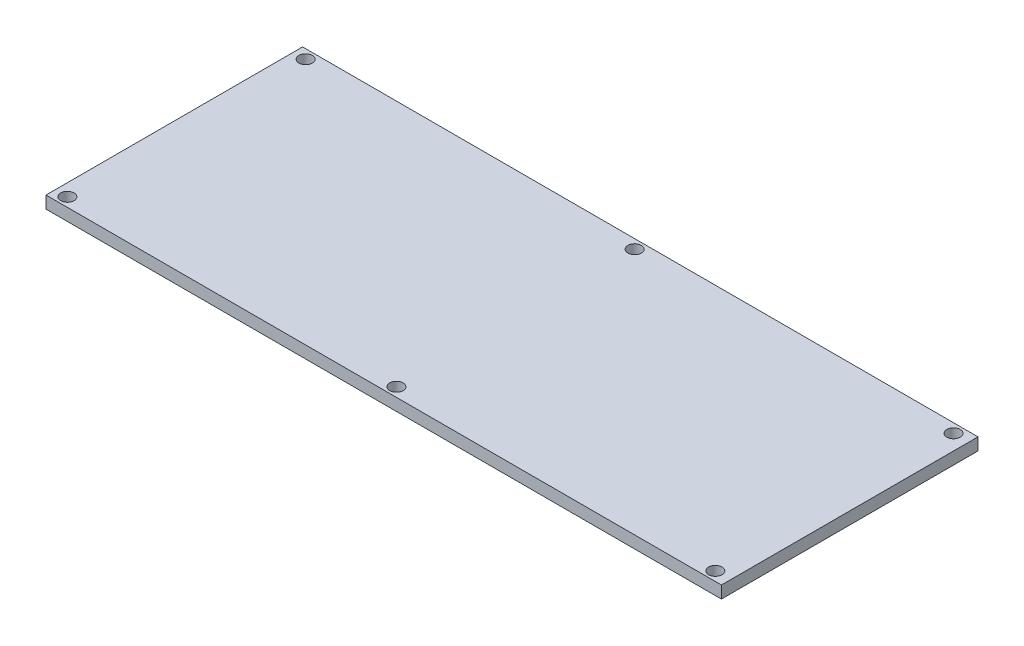
ISO-10303-21;
HEADER;
FILE_DESCRIPTION(('STEP AP214'),'2;1');
FILE_NAME('part.step','',(''),(''),'','','');
FILE_SCHEMA(('AUTOMOTIVE_DESIGN { 1 0 10303 214 1 1 1 1 }'));
ENDSEC;
DATA;
#1=APPLICATION_CONTEXT('core data for automotive mechanical design processes');
#2=APPLICATION_PROTOCOL_DEFINITION('international standard','automotive_design',2000,#1);
#3=PRODUCT_CONTEXT('',#1,'mechanical');
#4=PRODUCT('Part','Part','',(#3));
#5=PRODUCT_RELATED_PRODUCT_CATEGORY('part','',(#4));
#6=PRODUCT_DEFINITION_FORMATION('','',#4);
#7=PRODUCT_DEFINITION_CONTEXT('part definition',#1,'design');
#8=PRODUCT_DEFINITION('design','',#6,#7);
#9=PRODUCT_DEFINITION_SHAPE('','',#8);
#10=(LENGTH_UNIT() NAMED_UNIT(*) SI_UNIT(.MILLI.,.METRE.));
#11=(NAMED_UNIT(*) PLANE_ANGLE_UNIT() SI_UNIT($,.RADIAN.));
#12=(NAMED_UNIT(*) SI_UNIT($,.STERADIAN.) SOLID_ANGLE_UNIT());
#13=UNCERTAINTY_MEASURE_WITH_UNIT(LENGTH_MEASURE(1.E-05),#10,'distance_accuracy_value','');
#14=(GEOMETRIC_REPRESENTATION_CONTEXT(3) GLOBAL_UNCERTAINTY_ASSIGNED_CONTEXT((#13)) GLOBAL_UNIT_ASSIGNED_CONTEXT((#10,
#11,#12)) REPRESENTATION_CONTEXT('',''));
#15=CARTESIAN_POINT('',(0.,0.,0.));
#16=DIRECTION('',(0.,0.,1.));
#17=DIRECTION('',(1.,0.,0.));
#18=AXIS2_PLACEMENT_3D('',#15,#16,#17);
#19=CARTESIAN_POINT('',(55.28,2.,21.));
#20=DIRECTION('',(-1.,0.,0.));
#21=DIRECTION('',(0.,0.,1.));
#22=AXIS2_PLACEMENT_3D('',#19,#20,#21);
#23=PLANE('',#22);
#24=DIRECTION('',(0.,0.,-1.));
#25=VECTOR('',#24,1.);
#26=CARTESIAN_POINT('',(55.28,0.,21.));
#27=LINE('',#26,#25);
#28=CARTESIAN_POINT('',(55.28,0.,21.));
#29=VERTEX_POINT('',#28);
#30=CARTESIAN_POINT('',(55.28,0.,-21.));
#31=VERTEX_POINT('',#30);
#32=EDGE_CURVE('E98',#29,#31,#27,.T.);
#33=ORIENTED_EDGE('',*,*,#32,.T.);
#34=DIRECTION('',(0.,-1.,0.));
#35=VECTOR('',#34,1.);
#36=CARTESIAN_POINT('',(55.28,2.,-21.));
#37=LINE('',#36,#35);
#38=CARTESIAN_POINT('',(55.28,2.,-21.));
#39=VERTEX_POINT('',#38);
#40=EDGE_CURVE('E11',#39,#31,#37,.T.);
#41=ORIENTED_EDGE('',*,*,#40,.F.);
#42=DIRECTION('',(0.,0.,-1.));
#43=VECTOR('',#42,1.);
#44=CARTESIAN_POINT('',(55.28,2.,21.));
#45=LINE('',#44,#43);
#46=CARTESIAN_POINT('',(55.28,2.,21.));
#47=VERTEX_POINT('',#46);
#48=EDGE_CURVE('E86',#47,#39,#45,.T.);
#49=ORIENTED_EDGE('',*,*,#48,.F.);
#50=DIRECTION('',(0.,-1.,0.));
#51=VECTOR('',#50,1.);
#52=CARTESIAN_POINT('',(55.28,2.,21.));
#53=LINE('',#52,#51);
#54=EDGE_CURVE('E94',#47,#29,#53,.T.);
#55=ORIENTED_EDGE('',*,*,#54,.T.);
#56=EDGE_LOOP('',(#33,#41,#49,#55));
#57=FACE_BOUND('',#56,.T.);
#58=ADVANCED_FACE('F35',(#57),#23,.F.);
#59=CARTESIAN_POINT('',(-55.28,2.,-21.));
#60=DIRECTION('',(0.,0.,1.));
#61=DIRECTION('',(1.,0.,0.));
#62=AXIS2_PLACEMENT_3D('',#59,#60,#61);
#63=PLANE('',#62);
#64=DIRECTION('',(-1.,0.,0.));
#65=VECTOR('',#64,1.);
#66=CARTESIAN_POINT('',(-55.28,0.,-21.));
#67=LINE('',#66,#65);
#68=CARTESIAN_POINT('',(-55.28,0.,-21.));
#69=VERTEX_POINT('',#68);
#70=EDGE_CURVE('E90',#31,#69,#67,.T.);
#71=ORIENTED_EDGE('',*,*,#70,.T.);
#72=DIRECTION('',(0.,-1.,0.));
#73=VECTOR('',#72,1.);
#74=CARTESIAN_POINT('',(-55.28,2.,-21.));
#75=LINE('',#74,#73);
#76=CARTESIAN_POINT('',(-55.28,2.,-21.));
#77=VERTEX_POINT('',#76);
#78=EDGE_CURVE('E43',#77,#69,#75,.T.);
#79=ORIENTED_EDGE('',*,*,#78,.F.);
#80=DIRECTION('',(-1.,0.,0.));
#81=VECTOR('',#80,1.);
#82=CARTESIAN_POINT('',(-55.28,2.,-21.));
#83=LINE('',#82,#81);
#84=EDGE_CURVE('E81',#39,#77,#83,.T.);
#85=ORIENTED_EDGE('',*,*,#84,.F.);
#86=ORIENTED_EDGE('',*,*,#40,.T.);
#87=EDGE_LOOP('',(#71,#79,#85,#86));
#88=FACE_BOUND('',#87,.T.);
#89=ADVANCED_FACE('F89',(#88),#63,.F.);
#90=CARTESIAN_POINT('',(-55.28,2.,21.));
#91=DIRECTION('',(1.,0.,0.));
#92=DIRECTION('',(0.,0.,-1.));
#93=AXIS2_PLACEMENT_3D('',#90,#91,#92);
#94=PLANE('',#93);
#95=DIRECTION('',(0.,0.,1.));
#96=VECTOR('',#95,1.);
#97=CARTESIAN_POINT('',(-55.28,0.,21.));
#98=LINE('',#97,#96);
#99=CARTESIAN_POINT('',(-55.28,0.,21.));
#100=VERTEX_POINT('',#99);
#101=EDGE_CURVE('E68',#69,#100,#98,.T.);
#102=ORIENTED_EDGE('',*,*,#101,.T.);
#103=DIRECTION('',(0.,-1.,0.));
#104=VECTOR('',#103,1.);
#105=CARTESIAN_POINT('',(-55.28,2.,21.));
#106=LINE('',#105,#104);
#107=CARTESIAN_POINT('',(-55.28,2.,21.));
#108=VERTEX_POINT('',#107);
#109=EDGE_CURVE('E91',#108,#100,#106,.T.);
#110=ORIENTED_EDGE('',*,*,#109,.F.);
#111=DIRECTION('',(0.,0.,1.));
#112=VECTOR('',#111,1.);
#113=CARTESIAN_POINT('',(-55.28,2.,21.));
#114=LINE('',#113,#112);
#115=EDGE_CURVE('E84',#77,#108,#114,.T.);
#116=ORIENTED_EDGE('',*,*,#115,.F.);
#117=ORIENTED_EDGE('',*,*,#78,.T.);
#118=EDGE_LOOP('',(#102,#110,#116,#117));
#119=FACE_BOUND('',#118,.T.);
#120=ADVANCED_FACE('F92',(#119),#94,.F.);
#121=CARTESIAN_POINT('',(-55.28,2.,21.));
#122=DIRECTION('',(0.,0.,-1.));
#123=DIRECTION('',(-1.,0.,0.));
#124=AXIS2_PLACEMENT_3D('',#121,#122,#123);
#125=PLANE('',#124);
#126=DIRECTION('',(1.,0.,0.));
#127=VECTOR('',#126,1.);
#128=CARTESIAN_POINT('',(-55.28,0.,21.));
#129=LINE('',#128,#127);
#130=EDGE_CURVE('E74',#100,#29,#129,.T.);
#131=ORIENTED_EDGE('',*,*,#130,.T.);
#132=ORIENTED_EDGE('',*,*,#54,.F.);
#133=DIRECTION('',(1.,0.,0.));
#134=VECTOR('',#133,1.);
#135=CARTESIAN_POINT('',(-55.28,2.,21.));
#136=LINE('',#135,#134);
#137=EDGE_CURVE('E51',#108,#47,#136,.T.);
#138=ORIENTED_EDGE('',*,*,#137,.F.);
#139=ORIENTED_EDGE('',*,*,#109,.T.);
#140=EDGE_LOOP('',(#131,#132,#138,#139));
#141=FACE_BOUND('',#140,.T.);
#142=ADVANCED_FACE('F106',(#141),#125,.F.);
#143=CARTESIAN_POINT('',(0.,2.,0.));
#144=DIRECTION('',(0.,-1.,0.));
#145=DIRECTION('',(0.,0.,-1.));
#146=AXIS2_PLACEMENT_3D('',#143,#144,#145);
#147=PLANE('',#146);
#148=CARTESIAN_POINT('',(-53.28,2.,19.5));
#149=DIRECTION('',(0.,-1.,0.));
#150=DIRECTION('',(0.,0.,-1.));
#151=AXIS2_PLACEMENT_3D('',#148,#149,#150);
#152=CIRCLE('',#151,1.1);
#153=CARTESIAN_POINT('',(-53.28,2.,18.4));
#154=VERTEX_POINT('',#153);
#155=EDGE_CURVE('E141',#154,#154,#152,.T.);
#156=ORIENTED_EDGE('',*,*,#155,.T.);
#157=EDGE_LOOP('',(#156));
#158=FACE_BOUND('',#157,.T.);
#159=CARTESIAN_POINT('',(-53.28,2.,-19.5));
#160=DIRECTION('',(0.,-1.,0.));
#161=DIRECTION('',(0.,0.,-1.));
#162=AXIS2_PLACEMENT_3D('',#159,#160,#161);
#163=CIRCLE('',#162,1.1);
#164=CARTESIAN_POINT('',(-53.28,2.,-20.6));
#165=VERTEX_POINT('',#164);
#166=EDGE_CURVE('E135',#165,#165,#163,.T.);
#167=ORIENTED_EDGE('',*,*,#166,.T.);
#168=EDGE_LOOP('',(#167));
#169=FACE_BOUND('',#168,.T.);
#170=CARTESIAN_POINT('',(52.78,2.,-19.5));
#171=DIRECTION('',(0.,-1.,0.));
#172=DIRECTION('',(0.,0.,-1.));
#173=AXIS2_PLACEMENT_3D('',#170,#171,#172);
#174=CIRCLE('',#173,1.1);
#175=CARTESIAN_POINT('',(52.78,2.,-20.6));
#176=VERTEX_POINT('',#175);
#177=EDGE_CURVE('E129',#176,#176,#174,.T.);
#178=ORIENTED_EDGE('',*,*,#177,.T.);
#179=EDGE_LOOP('',(#178));
#180=FACE_BOUND('',#179,.T.);
#181=CARTESIAN_POINT('',(0.579521869390018,2.,-19.5));
#182=DIRECTION('',(0.,-1.,0.));
#183=DIRECTION('',(0.,0.,-1.));
#184=AXIS2_PLACEMENT_3D('',#181,#182,#183);
#185=CIRCLE('',#184,1.1);
#186=CARTESIAN_POINT('',(0.579521869390018,2.,-20.6));
#187=VERTEX_POINT('',#186);
#188=EDGE_CURVE('E123',#187,#187,#185,.T.);
#189=ORIENTED_EDGE('',*,*,#188,.T.);
#190=EDGE_LOOP('',(#189));
#191=FACE_BOUND('',#190,.T.);
#192=CARTESIAN_POINT('',(0.579521869390073,2.,19.5));
#193=DIRECTION('',(0.,-1.,0.));
#194=DIRECTION('',(0.,0.,-1.));
#195=AXIS2_PLACEMENT_3D('',#192,#193,#194);
#196=CIRCLE('',#195,1.1);
#197=CARTESIAN_POINT('',(0.579521869390073,2.,18.4));
#198=VERTEX_POINT('',#197);
#199=EDGE_CURVE('E117',#198,#198,#196,.T.);
#200=ORIENTED_EDGE('',*,*,#199,.T.);
#201=EDGE_LOOP('',(#200));
#202=FACE_BOUND('',#201,.T.);
#203=CARTESIAN_POINT('',(52.7800000000001,2.,19.5));
#204=DIRECTION('',(0.,-1.,0.));
#205=DIRECTION('',(0.,0.,-1.));
#206=AXIS2_PLACEMENT_3D('',#203,#204,#205);
#207=CIRCLE('',#206,1.1);
#208=CARTESIAN_POINT('',(52.7800000000001,2.,18.4));
#209=VERTEX_POINT('',#208);
#210=EDGE_CURVE('E101',#209,#209,#207,.T.);
#211=ORIENTED_EDGE('',*,*,#210,.T.);
#212=EDGE_LOOP('',(#211));
#213=FACE_BOUND('',#212,.T.);
#214=ORIENTED_EDGE('',*,*,#48,.T.);
#215=ORIENTED_EDGE('',*,*,#84,.T.);
#216=ORIENTED_EDGE('',*,*,#115,.T.);
#217=ORIENTED_EDGE('',*,*,#137,.T.);
#218=EDGE_LOOP('',(#214,#215,#216,#217));
#219=FACE_BOUND('',#218,.T.);
#220=ADVANCED_FACE('F82',(#158,#169,#180,#191,#202,#213,#219),#147,.F.);
#221=CARTESIAN_POINT('',(0.,0.,0.));
#222=DIRECTION('',(0.,-1.,0.));
#223=DIRECTION('',(0.,0.,-1.));
#224=AXIS2_PLACEMENT_3D('',#221,#222,#223);
#225=PLANE('',#224);
#226=CARTESIAN_POINT('',(-53.28,0.,19.5));
#227=DIRECTION('',(0.,-1.,0.));
#228=DIRECTION('',(0.,0.,-1.));
#229=AXIS2_PLACEMENT_3D('',#226,#227,#228);
#230=CIRCLE('',#229,1.1);
#231=CARTESIAN_POINT('',(-53.28,0.,18.4));
#232=VERTEX_POINT('',#231);
#233=EDGE_CURVE('E144',#232,#232,#230,.T.);
#234=ORIENTED_EDGE('',*,*,#233,.F.);
#235=EDGE_LOOP('',(#234));
#236=FACE_BOUND('',#235,.T.);
#237=CARTESIAN_POINT('',(-53.28,0.,-19.5));
#238=DIRECTION('',(0.,-1.,0.));
#239=DIRECTION('',(0.,0.,-1.));
#240=AXIS2_PLACEMENT_3D('',#237,#238,#239);
#241=CIRCLE('',#240,1.1);
#242=CARTESIAN_POINT('',(-53.28,0.,-20.6));
#243=VERTEX_POINT('',#242);
#244=EDGE_CURVE('E138',#243,#243,#241,.T.);
#245=ORIENTED_EDGE('',*,*,#244,.F.);
#246=EDGE_LOOP('',(#245));
#247=FACE_BOUND('',#246,.T.);
#248=CARTESIAN_POINT('',(52.78,0.,-19.5));
#249=DIRECTION('',(0.,-1.,0.));
#250=DIRECTION('',(0.,0.,-1.));
#251=AXIS2_PLACEMENT_3D('',#248,#249,#250);
#252=CIRCLE('',#251,1.1);
#253=CARTESIAN_POINT('',(52.78,0.,-20.6));
#254=VERTEX_POINT('',#253);
#255=EDGE_CURVE('E132',#254,#254,#252,.T.);
#256=ORIENTED_EDGE('',*,*,#255,.F.);
#257=EDGE_LOOP('',(#256));
#258=FACE_BOUND('',#257,.T.);
#259=CARTESIAN_POINT('',(0.579521869390018,0.,-19.5));
#260=DIRECTION('',(0.,-1.,0.));
#261=DIRECTION('',(0.,0.,-1.));
#262=AXIS2_PLACEMENT_3D('',#259,#260,#261);
#263=CIRCLE('',#262,1.1);
#264=CARTESIAN_POINT('',(0.579521869390018,0.,-20.6));
#265=VERTEX_POINT('',#264);
#266=EDGE_CURVE('E126',#265,#265,#263,.T.);
#267=ORIENTED_EDGE('',*,*,#266,.F.);
#268=EDGE_LOOP('',(#267));
#269=FACE_BOUND('',#268,.T.);
#270=CARTESIAN_POINT('',(0.579521869390073,0.,19.5));
#271=DIRECTION('',(0.,-1.,0.));
#272=DIRECTION('',(0.,0.,-1.));
#273=AXIS2_PLACEMENT_3D('',#270,#271,#272);
#274=CIRCLE('',#273,1.1);
#275=CARTESIAN_POINT('',(0.579521869390073,0.,18.4));
#276=VERTEX_POINT('',#275);
#277=EDGE_CURVE('E120',#276,#276,#274,.T.);
#278=ORIENTED_EDGE('',*,*,#277,.F.);
#279=EDGE_LOOP('',(#278));
#280=FACE_BOUND('',#279,.T.);
#281=CARTESIAN_POINT('',(52.7800000000001,0.,19.5));
#282=DIRECTION('',(0.,-1.,0.));
#283=DIRECTION('',(0.,0.,-1.));
#284=AXIS2_PLACEMENT_3D('',#281,#282,#283);
#285=CIRCLE('',#284,1.1);
#286=CARTESIAN_POINT('',(52.7800000000001,0.,18.4));
#287=VERTEX_POINT('',#286);
#288=EDGE_CURVE('E114',#287,#287,#285,.T.);
#289=ORIENTED_EDGE('',*,*,#288,.F.);
#290=EDGE_LOOP('',(#289));
#291=FACE_BOUND('',#290,.T.);
#292=ORIENTED_EDGE('',*,*,#32,.F.);
#293=ORIENTED_EDGE('',*,*,#130,.F.);
#294=ORIENTED_EDGE('',*,*,#101,.F.);
#295=ORIENTED_EDGE('',*,*,#70,.F.);
#296=EDGE_LOOP('',(#292,#293,#294,#295));
#297=FACE_BOUND('',#296,.T.);
#298=ADVANCED_FACE('F109',(#236,#247,#258,#269,#280,#291,#297),#225,.T.);
#299=CARTESIAN_POINT('',(52.7800000000001,0.,19.5));
#300=DIRECTION('',(0.,-1.,0.));
#301=DIRECTION('',(0.,0.,-1.));
#302=AXIS2_PLACEMENT_3D('',#299,#300,#301);
#303=CYLINDRICAL_SURFACE('',#302,1.1);
#304=ORIENTED_EDGE('',*,*,#210,.F.);
#305=EDGE_LOOP('',(#304));
#306=FACE_BOUND('',#305,.T.);
#307=ORIENTED_EDGE('',*,*,#288,.T.);
#308=EDGE_LOOP('',(#307));
#309=FACE_BOUND('',#308,.T.);
#310=ADVANCED_FACE('F152',(#306,#309),#303,.F.);
#311=CARTESIAN_POINT('',(0.579521869390073,0.,19.5));
#312=DIRECTION('',(0.,-1.,0.));
#313=DIRECTION('',(0.,0.,-1.));
#314=AXIS2_PLACEMENT_3D('',#311,#312,#313);
#315=CYLINDRICAL_SURFACE('',#314,1.1);
#316=ORIENTED_EDGE('',*,*,#199,.F.);
#317=EDGE_LOOP('',(#316));
#318=FACE_BOUND('',#317,.T.);
#319=ORIENTED_EDGE('',*,*,#277,.T.);
#320=EDGE_LOOP('',(#319));
#321=FACE_BOUND('',#320,.T.);
#322=ADVANCED_FACE('F165',(#318,#321),#315,.F.);
#323=CARTESIAN_POINT('',(0.579521869390018,0.,-19.5));
#324=DIRECTION('',(0.,-1.,0.));
#325=DIRECTION('',(0.,0.,-1.));
#326=AXIS2_PLACEMENT_3D('',#323,#324,#325);
#327=CYLINDRICAL_SURFACE('',#326,1.1);
#328=ORIENTED_EDGE('',*,*,#188,.F.);
#329=EDGE_LOOP('',(#328));
#330=FACE_BOUND('',#329,.T.);
#331=ORIENTED_EDGE('',*,*,#266,.T.);
#332=EDGE_LOOP('',(#331));
#333=FACE_BOUND('',#332,.T.);
#334=ADVANCED_FACE('F171',(#330,#333),#327,.F.);
#335=CARTESIAN_POINT('',(52.78,0.,-19.5));
#336=DIRECTION('',(0.,-1.,0.));
#337=DIRECTION('',(0.,0.,-1.));
#338=AXIS2_PLACEMENT_3D('',#335,#336,#337);
#339=CYLINDRICAL_SURFACE('',#338,1.1);
#340=ORIENTED_EDGE('',*,*,#177,.F.);
#341=EDGE_LOOP('',(#340));
#342=FACE_BOUND('',#341,.T.);
#343=ORIENTED_EDGE('',*,*,#255,.T.);
#344=EDGE_LOOP('',(#343));
#345=FACE_BOUND('',#344,.T.);
#346=ADVANCED_FACE('F204',(#342,#345),#339,.F.);
#347=CARTESIAN_POINT('',(-53.28,0.,-19.5));
#348=DIRECTION('',(0.,-1.,0.));
#349=DIRECTION('',(0.,0.,-1.));
#350=AXIS2_PLACEMENT_3D('',#347,#348,#349);
#351=CYLINDRICAL_SURFACE('',#350,1.1);
#352=ORIENTED_EDGE('',*,*,#166,.F.);
#353=EDGE_LOOP('',(#352));
#354=FACE_BOUND('',#353,.T.);
#355=ORIENTED_EDGE('',*,*,#244,.T.);
#356=EDGE_LOOP('',(#355));
#357=FACE_BOUND('',#356,.T.);
#358=ADVANCED_FACE('F209',(#354,#357),#351,.F.);
#359=CARTESIAN_POINT('',(-53.28,0.,19.5));
#360=DIRECTION('',(0.,-1.,0.));
#361=DIRECTION('',(0.,0.,-1.));
#362=AXIS2_PLACEMENT_3D('',#359,#360,#361);
#363=CYLINDRICAL_SURFACE('',#362,1.1);
#364=ORIENTED_EDGE('',*,*,#155,.F.);
#365=EDGE_LOOP('',(#364));
#366=FACE_BOUND('',#365,.T.);
#367=ORIENTED_EDGE('',*,*,#233,.T.);
#368=EDGE_LOOP('',(#367));
#369=FACE_BOUND('',#368,.T.);
#370=ADVANCED_FACE('F148',(#366,#369),#363,.F.);
#371=CLOSED_SHELL('',(#58,#89,#120,#142,#220,#298,#310,#322,#334,#346,#358,#370));
#372=MANIFOLD_SOLID_BREP('B2',#371);
#373=ADVANCED_BREP_SHAPE_REPRESENTATION('',(#18,#372),#14);
#374=SHAPE_DEFINITION_REPRESENTATION(#9,#373);
ENDSEC;
END-ISO-10303-21;
